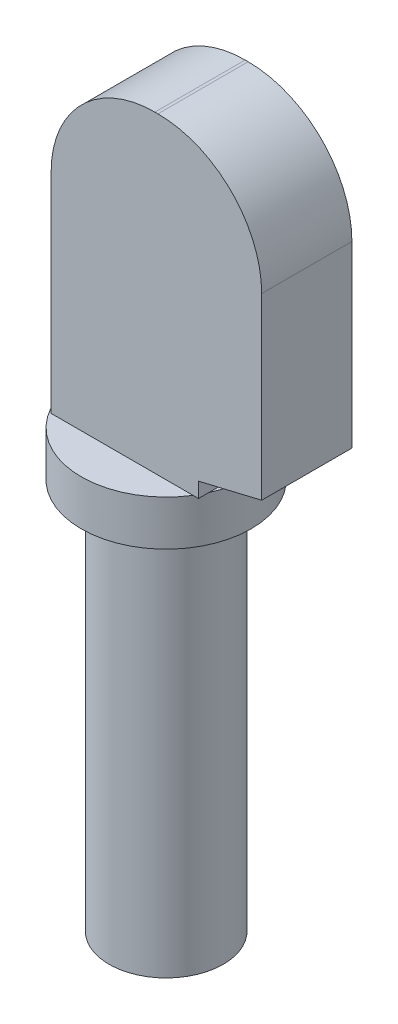
ISO-10303-21;
HEADER;
FILE_DESCRIPTION(('STEP AP214'),'2;1');
FILE_NAME('part.step','',(''),(''),'','','');
FILE_SCHEMA(('AUTOMOTIVE_DESIGN { 1 0 10303 214 1 1 1 1 }'));
ENDSEC;
DATA;
#1=APPLICATION_CONTEXT('core data for automotive mechanical design processes');
#2=APPLICATION_PROTOCOL_DEFINITION('international standard','automotive_design',2000,#1);
#3=PRODUCT_CONTEXT('',#1,'mechanical');
#4=PRODUCT('Part','Part','',(#3));
#5=PRODUCT_RELATED_PRODUCT_CATEGORY('part','',(#4));
#6=PRODUCT_DEFINITION_FORMATION('','',#4);
#7=PRODUCT_DEFINITION_CONTEXT('part definition',#1,'design');
#8=PRODUCT_DEFINITION('design','',#6,#7);
#9=PRODUCT_DEFINITION_SHAPE('','',#8);
#10=(LENGTH_UNIT() NAMED_UNIT(*) SI_UNIT(.MILLI.,.METRE.));
#11=(NAMED_UNIT(*) PLANE_ANGLE_UNIT() SI_UNIT($,.RADIAN.));
#12=(NAMED_UNIT(*) SI_UNIT($,.STERADIAN.) SOLID_ANGLE_UNIT());
#13=UNCERTAINTY_MEASURE_WITH_UNIT(LENGTH_MEASURE(1.E-05),#10,'distance_accuracy_value','');
#14=(GEOMETRIC_REPRESENTATION_CONTEXT(3) GLOBAL_UNCERTAINTY_ASSIGNED_CONTEXT((#13)) GLOBAL_UNIT_ASSIGNED_CONTEXT((#10,
#11,#12)) REPRESENTATION_CONTEXT('',''));
#15=CARTESIAN_POINT('',(0.,0.,0.));
#16=DIRECTION('',(0.,0.,1.));
#17=DIRECTION('',(1.,0.,0.));
#18=AXIS2_PLACEMENT_3D('',#15,#16,#17);
#19=CARTESIAN_POINT('',(2.825,14.5,0.));
#20=DIRECTION('',(0.,1.,0.));
#21=DIRECTION('',(0.,0.,1.));
#22=AXIS2_PLACEMENT_3D('',#19,#20,#21);
#23=PLANE('',#22);
#24=DIRECTION('',(0.,0.,-1.));
#25=VECTOR('',#24,1.);
#26=CARTESIAN_POINT('',(-2.325,14.5,1.5));
#27=LINE('',#26,#25);
#28=CARTESIAN_POINT('',(-2.325,14.5,1.5));
#29=VERTEX_POINT('',#28);
#30=CARTESIAN_POINT('',(-2.325,14.5,-1.5));
#31=VERTEX_POINT('',#30);
#32=EDGE_CURVE('E211',#29,#31,#27,.T.);
#33=ORIENTED_EDGE('',*,*,#32,.T.);
#34=DIRECTION('',(1.,0.,0.));
#35=VECTOR('',#34,1.);
#36=CARTESIAN_POINT('',(2.575,14.5,-1.5));
#37=LINE('',#36,#35);
#38=CARTESIAN_POINT('',(2.39387238590531,14.5,-1.5));
#39=VERTEX_POINT('',#38);
#40=EDGE_CURVE('E58',#31,#39,#37,.T.);
#41=ORIENTED_EDGE('',*,*,#40,.T.);
#42=CARTESIAN_POINT('',(0.,14.5,0.));
#43=DIRECTION('',(0.,-1.,0.));
#44=DIRECTION('',(0.,0.,-1.));
#45=AXIS2_PLACEMENT_3D('',#42,#43,#44);
#46=CIRCLE('',#45,2.825);
#47=CARTESIAN_POINT('',(2.39387238590531,14.5,1.5));
#48=VERTEX_POINT('',#47);
#49=EDGE_CURVE('E144',#48,#39,#46,.T.);
#50=ORIENTED_EDGE('',*,*,#49,.F.);
#51=DIRECTION('',(1.,0.,0.));
#52=VECTOR('',#51,1.);
#53=CARTESIAN_POINT('',(2.575,14.5,1.5));
#54=LINE('',#53,#52);
#55=EDGE_CURVE('E125',#29,#48,#54,.T.);
#56=ORIENTED_EDGE('',*,*,#55,.F.);
#57=EDGE_LOOP('',(#33,#41,#50,#56));
#58=FACE_BOUND('',#57,.T.);
#59=ADVANCED_FACE('F39',(#58),#23,.T.);
#60=CARTESIAN_POINT('',(0.,0.,0.));
#61=DIRECTION('',(0.,-1.,0.));
#62=DIRECTION('',(0.,0.,-1.));
#63=AXIS2_PLACEMENT_3D('',#60,#61,#62);
#64=PLANE('',#63);
#65=CARTESIAN_POINT('',(0.,0.,0.));
#66=DIRECTION('',(0.,-1.,0.));
#67=DIRECTION('',(0.,0.,-1.));
#68=AXIS2_PLACEMENT_3D('',#65,#66,#67);
#69=CIRCLE('',#68,1.9);
#70=CARTESIAN_POINT('',(0.,0.,-1.9));
#71=VERTEX_POINT('',#70);
#72=EDGE_CURVE('E43',#71,#71,#69,.T.);
#73=ORIENTED_EDGE('',*,*,#72,.T.);
#74=EDGE_LOOP('',(#73));
#75=FACE_BOUND('',#74,.T.);
#76=ADVANCED_FACE('F41',(#75),#64,.T.);
#77=CARTESIAN_POINT('',(0.,0.,0.));
#78=DIRECTION('',(0.,-1.,0.));
#79=DIRECTION('',(0.,0.,-1.));
#80=AXIS2_PLACEMENT_3D('',#77,#78,#79);
#81=CYLINDRICAL_SURFACE('',#80,1.9);
#82=CARTESIAN_POINT('',(0.,13.,0.));
#83=DIRECTION('',(0.,-1.,0.));
#84=DIRECTION('',(0.,0.,-1.));
#85=AXIS2_PLACEMENT_3D('',#82,#83,#84);
#86=CIRCLE('',#85,1.9);
#87=CARTESIAN_POINT('',(0.,13.,-1.9));
#88=VERTEX_POINT('',#87);
#89=EDGE_CURVE('E159',#88,#88,#86,.T.);
#90=ORIENTED_EDGE('',*,*,#89,.T.);
#91=EDGE_LOOP('',(#90));
#92=FACE_BOUND('',#91,.T.);
#93=ORIENTED_EDGE('',*,*,#72,.F.);
#94=EDGE_LOOP('',(#93));
#95=FACE_BOUND('',#94,.T.);
#96=ADVANCED_FACE('F169',(#92,#95),#81,.T.);
#97=CARTESIAN_POINT('',(1.9,13.,0.));
#98=DIRECTION('',(0.,-1.,0.));
#99=DIRECTION('',(0.,0.,-1.));
#100=AXIS2_PLACEMENT_3D('',#97,#98,#99);
#101=PLANE('',#100);
#102=CARTESIAN_POINT('',(0.,13.,0.));
#103=DIRECTION('',(0.,-1.,0.));
#104=DIRECTION('',(0.,0.,-1.));
#105=AXIS2_PLACEMENT_3D('',#102,#103,#104);
#106=CIRCLE('',#105,2.825);
#107=CARTESIAN_POINT('',(0.,13.,-2.825));
#108=VERTEX_POINT('',#107);
#109=EDGE_CURVE('E155',#108,#108,#106,.T.);
#110=ORIENTED_EDGE('',*,*,#109,.T.);
#111=EDGE_LOOP('',(#110));
#112=FACE_BOUND('',#111,.T.);
#113=ORIENTED_EDGE('',*,*,#89,.F.);
#114=EDGE_LOOP('',(#113));
#115=FACE_BOUND('',#114,.T.);
#116=ADVANCED_FACE('F171',(#112,#115),#101,.T.);
#117=CARTESIAN_POINT('',(0.,0.,0.));
#118=DIRECTION('',(0.,-1.,0.));
#119=DIRECTION('',(0.,0.,-1.));
#120=AXIS2_PLACEMENT_3D('',#117,#118,#119);
#121=CYLINDRICAL_SURFACE('',#120,2.825);
#122=CARTESIAN_POINT('',(2.575,14.5,-1.16189500386222));
#123=VERTEX_POINT('',#122);
#124=EDGE_CURVE('E149',#39,#123,#46,.T.);
#125=ORIENTED_EDGE('',*,*,#124,.T.);
#126=CARTESIAN_POINT('',(2.575,14.5,1.16189500386222));
#127=VERTEX_POINT('',#126);
#128=EDGE_CURVE('E156',#123,#127,#46,.T.);
#129=ORIENTED_EDGE('',*,*,#128,.T.);
#130=EDGE_CURVE('E142',#127,#48,#46,.T.);
#131=ORIENTED_EDGE('',*,*,#130,.T.);
#132=ORIENTED_EDGE('',*,*,#49,.T.);
#133=EDGE_LOOP('',(#125,#129,#131,#132));
#134=FACE_BOUND('',#133,.T.);
#135=ORIENTED_EDGE('',*,*,#109,.F.);
#136=EDGE_LOOP('',(#135));
#137=FACE_BOUND('',#136,.T.);
#138=ADVANCED_FACE('F176',(#134,#137),#121,.T.);
#139=DIRECTION('',(0.,0.,-1.));
#140=VECTOR('',#139,1.);
#141=CARTESIAN_POINT('',(2.575,14.5,1.5));
#142=LINE('',#141,#140);
#143=EDGE_CURVE('E11',#127,#123,#142,.T.);
#144=ORIENTED_EDGE('',*,*,#143,.F.);
#145=ORIENTED_EDGE('',*,*,#128,.F.);
#146=EDGE_LOOP('',(#144,#145));
#147=FACE_BOUND('',#146,.T.);
#148=ADVANCED_FACE('F182',(#147),#23,.T.);
#149=CARTESIAN_POINT('',(2.575,14.5,1.5));
#150=DIRECTION('',(0.,1.,0.));
#151=DIRECTION('',(0.,0.,1.));
#152=AXIS2_PLACEMENT_3D('',#149,#150,#151);
#153=PLANE('',#152);
#154=ORIENTED_EDGE('',*,*,#124,.F.);
#155=CARTESIAN_POINT('',(2.575,14.5,-1.5));
#156=VERTEX_POINT('',#155);
#157=EDGE_CURVE('E203',#39,#156,#37,.T.);
#158=ORIENTED_EDGE('',*,*,#157,.T.);
#159=EDGE_CURVE('E51',#123,#156,#142,.T.);
#160=ORIENTED_EDGE('',*,*,#159,.F.);
#161=EDGE_LOOP('',(#154,#158,#160));
#162=FACE_BOUND('',#161,.T.);
#163=ADVANCED_FACE('F189',(#162),#153,.F.);
#164=ORIENTED_EDGE('',*,*,#130,.F.);
#165=CARTESIAN_POINT('',(2.575,14.5,1.5));
#166=VERTEX_POINT('',#165);
#167=EDGE_CURVE('E50',#166,#127,#142,.T.);
#168=ORIENTED_EDGE('',*,*,#167,.F.);
#169=EDGE_CURVE('E66',#48,#166,#54,.T.);
#170=ORIENTED_EDGE('',*,*,#169,.F.);
#171=EDGE_LOOP('',(#164,#168,#170));
#172=FACE_BOUND('',#171,.T.);
#173=ADVANCED_FACE('F140',(#172),#153,.F.);
#174=CARTESIAN_POINT('',(2.575,15.,1.5));
#175=DIRECTION('',(-1.,0.,0.));
#176=DIRECTION('',(0.,-1.,0.));
#177=AXIS2_PLACEMENT_3D('',#174,#175,#176);
#178=PLANE('',#177);
#179=DIRECTION('',(0.,1.,0.));
#180=VECTOR('',#179,1.);
#181=CARTESIAN_POINT('',(2.575,15.,-1.5));
#182=LINE('',#181,#180);
#183=CARTESIAN_POINT('',(2.575,15.,-1.5));
#184=VERTEX_POINT('',#183);
#185=EDGE_CURVE('E207',#156,#184,#182,.T.);
#186=ORIENTED_EDGE('',*,*,#185,.T.);
#187=DIRECTION('',(0.,0.,-1.));
#188=VECTOR('',#187,1.);
#189=CARTESIAN_POINT('',(2.575,15.,1.5));
#190=LINE('',#189,#188);
#191=CARTESIAN_POINT('',(2.575,15.,1.5));
#192=VERTEX_POINT('',#191);
#193=EDGE_CURVE('E135',#192,#184,#190,.T.);
#194=ORIENTED_EDGE('',*,*,#193,.F.);
#195=DIRECTION('',(0.,1.,0.));
#196=VECTOR('',#195,1.);
#197=CARTESIAN_POINT('',(2.575,15.,1.5));
#198=LINE('',#197,#196);
#199=EDGE_CURVE('E122',#166,#192,#198,.T.);
#200=ORIENTED_EDGE('',*,*,#199,.F.);
#201=ORIENTED_EDGE('',*,*,#167,.T.);
#202=ORIENTED_EDGE('',*,*,#143,.T.);
#203=ORIENTED_EDGE('',*,*,#159,.T.);
#204=EDGE_LOOP('',(#186,#194,#200,#201,#202,#203));
#205=FACE_BOUND('',#204,.T.);
#206=ADVANCED_FACE('F132',(#205),#178,.F.);
#207=CARTESIAN_POINT('',(4.675,15.5,1.5));
#208=DIRECTION('',(-0.23162052730604,0.972806214685367,0.));
#209=DIRECTION('',(-0.972806214685367,-0.23162052730604,0.));
#210=AXIS2_PLACEMENT_3D('',#207,#208,#209);
#211=PLANE('',#210);
#212=DIRECTION('',(0.972806214685367,0.23162052730604,0.));
#213=VECTOR('',#212,1.);
#214=CARTESIAN_POINT('',(4.675,15.5,-1.5));
#215=LINE('',#214,#213);
#216=CARTESIAN_POINT('',(4.675,15.5,-1.5));
#217=VERTEX_POINT('',#216);
#218=EDGE_CURVE('E214',#184,#217,#215,.T.);
#219=ORIENTED_EDGE('',*,*,#218,.T.);
#220=DIRECTION('',(0.,0.,-1.));
#221=VECTOR('',#220,1.);
#222=CARTESIAN_POINT('',(4.675,15.5,1.5));
#223=LINE('',#222,#221);
#224=CARTESIAN_POINT('',(4.675,15.5,1.5));
#225=VERTEX_POINT('',#224);
#226=EDGE_CURVE('E253',#225,#217,#223,.T.);
#227=ORIENTED_EDGE('',*,*,#226,.F.);
#228=DIRECTION('',(0.972806214685367,0.23162052730604,0.));
#229=VECTOR('',#228,1.);
#230=CARTESIAN_POINT('',(4.675,15.5,1.5));
#231=LINE('',#230,#229);
#232=EDGE_CURVE('E138',#192,#225,#231,.T.);
#233=ORIENTED_EDGE('',*,*,#232,.F.);
#234=ORIENTED_EDGE('',*,*,#193,.T.);
#235=EDGE_LOOP('',(#219,#227,#233,#234));
#236=FACE_BOUND('',#235,.T.);
#237=ADVANCED_FACE('F262',(#236),#211,.F.);
#238=CARTESIAN_POINT('',(4.675,21.45,1.5));
#239=DIRECTION('',(-1.,0.,0.));
#240=DIRECTION('',(0.,-1.,0.));
#241=AXIS2_PLACEMENT_3D('',#238,#239,#240);
#242=PLANE('',#241);
#243=DIRECTION('',(0.,1.,0.));
#244=VECTOR('',#243,1.);
#245=CARTESIAN_POINT('',(4.675,21.45,-1.5));
#246=LINE('',#245,#244);
#247=CARTESIAN_POINT('',(4.675,21.45,-1.5));
#248=VERTEX_POINT('',#247);
#249=EDGE_CURVE('E222',#217,#248,#246,.T.);
#250=ORIENTED_EDGE('',*,*,#249,.T.);
#251=DIRECTION('',(0.,0.,-1.));
#252=VECTOR('',#251,1.);
#253=CARTESIAN_POINT('',(4.675,21.45,1.5));
#254=LINE('',#253,#252);
#255=CARTESIAN_POINT('',(4.675,21.45,1.5));
#256=VERTEX_POINT('',#255);
#257=EDGE_CURVE('E250',#256,#248,#254,.T.);
#258=ORIENTED_EDGE('',*,*,#257,.F.);
#259=DIRECTION('',(0.,1.,0.));
#260=VECTOR('',#259,1.);
#261=CARTESIAN_POINT('',(4.675,21.45,1.5));
#262=LINE('',#261,#260);
#263=EDGE_CURVE('E275',#225,#256,#262,.T.);
#264=ORIENTED_EDGE('',*,*,#263,.F.);
#265=ORIENTED_EDGE('',*,*,#226,.T.);
#266=EDGE_LOOP('',(#250,#258,#264,#265));
#267=FACE_BOUND('',#266,.T.);
#268=ADVANCED_FACE('F266',(#267),#242,.F.);
#269=CARTESIAN_POINT('',(1.225,21.45,1.5));
#270=DIRECTION('',(0.,0.,-1.));
#271=DIRECTION('',(-1.,0.,0.));
#272=AXIS2_PLACEMENT_3D('',#269,#270,#271);
#273=CYLINDRICAL_SURFACE('',#272,3.45);
#274=CARTESIAN_POINT('',(1.225,21.45,-1.5));
#275=DIRECTION('',(0.,0.,1.));
#276=DIRECTION('',(-1.,0.,0.));
#277=AXIS2_PLACEMENT_3D('',#274,#275,#276);
#278=CIRCLE('',#277,3.45);
#279=CARTESIAN_POINT('',(1.225,24.9,-1.5));
#280=VERTEX_POINT('',#279);
#281=EDGE_CURVE('E225',#248,#280,#278,.T.);
#282=ORIENTED_EDGE('',*,*,#281,.T.);
#283=DIRECTION('',(0.,0.,-1.));
#284=VECTOR('',#283,1.);
#285=CARTESIAN_POINT('',(1.225,24.9,1.5));
#286=LINE('',#285,#284);
#287=CARTESIAN_POINT('',(1.225,24.9,1.5));
#288=VERTEX_POINT('',#287);
#289=EDGE_CURVE('E246',#288,#280,#286,.T.);
#290=ORIENTED_EDGE('',*,*,#289,.F.);
#291=CARTESIAN_POINT('',(1.225,21.45,1.5));
#292=DIRECTION('',(0.,0.,1.));
#293=DIRECTION('',(-1.,0.,0.));
#294=AXIS2_PLACEMENT_3D('',#291,#292,#293);
#295=CIRCLE('',#294,3.45);
#296=EDGE_CURVE('E271',#256,#288,#295,.T.);
#297=ORIENTED_EDGE('',*,*,#296,.F.);
#298=ORIENTED_EDGE('',*,*,#257,.T.);
#299=EDGE_LOOP('',(#282,#290,#297,#298));
#300=FACE_BOUND('',#299,.T.);
#301=ADVANCED_FACE('F269',(#300),#273,.T.);
#302=CARTESIAN_POINT('',(1.12500000000002,24.9,1.5));
#303=DIRECTION('',(0.,-1.,0.));
#304=DIRECTION('',(1.,0.,0.));
#305=AXIS2_PLACEMENT_3D('',#302,#303,#304);
#306=PLANE('',#305);
#307=DIRECTION('',(-1.,0.,0.));
#308=VECTOR('',#307,1.);
#309=CARTESIAN_POINT('',(1.12500000000002,24.9,-1.5));
#310=LINE('',#309,#308);
#311=CARTESIAN_POINT('',(1.12500000000002,24.9,-1.5));
#312=VERTEX_POINT('',#311);
#313=EDGE_CURVE('E228',#280,#312,#310,.T.);
#314=ORIENTED_EDGE('',*,*,#313,.T.);
#315=DIRECTION('',(0.,0.,-1.));
#316=VECTOR('',#315,1.);
#317=CARTESIAN_POINT('',(1.12500000000002,24.9,1.5));
#318=LINE('',#317,#316);
#319=CARTESIAN_POINT('',(1.12500000000002,24.9,1.5));
#320=VERTEX_POINT('',#319);
#321=EDGE_CURVE('E242',#320,#312,#318,.T.);
#322=ORIENTED_EDGE('',*,*,#321,.F.);
#323=DIRECTION('',(-1.,0.,0.));
#324=VECTOR('',#323,1.);
#325=CARTESIAN_POINT('',(1.12500000000002,24.9,1.5));
#326=LINE('',#325,#324);
#327=EDGE_CURVE('E274',#288,#320,#326,.T.);
#328=ORIENTED_EDGE('',*,*,#327,.F.);
#329=ORIENTED_EDGE('',*,*,#289,.T.);
#330=EDGE_LOOP('',(#314,#322,#328,#329));
#331=FACE_BOUND('',#330,.T.);
#332=ADVANCED_FACE('F297',(#331),#306,.F.);
#333=CARTESIAN_POINT('',(1.125,21.45,1.5));
#334=DIRECTION('',(0.,0.,-1.));
#335=DIRECTION('',(-1.,0.,0.));
#336=AXIS2_PLACEMENT_3D('',#333,#334,#335);
#337=CYLINDRICAL_SURFACE('',#336,3.45);
#338=CARTESIAN_POINT('',(1.125,21.45,-1.5));
#339=DIRECTION('',(0.,0.,1.));
#340=DIRECTION('',(-1.,0.,0.));
#341=AXIS2_PLACEMENT_3D('',#338,#339,#340);
#342=CIRCLE('',#341,3.45);
#343=CARTESIAN_POINT('',(-2.325,21.45,-1.5));
#344=VERTEX_POINT('',#343);
#345=EDGE_CURVE('E231',#312,#344,#342,.T.);
#346=ORIENTED_EDGE('',*,*,#345,.T.);
#347=DIRECTION('',(0.,0.,-1.));
#348=VECTOR('',#347,1.);
#349=CARTESIAN_POINT('',(-2.325,21.45,1.5));
#350=LINE('',#349,#348);
#351=CARTESIAN_POINT('',(-2.325,21.45,1.5));
#352=VERTEX_POINT('',#351);
#353=EDGE_CURVE('E238',#352,#344,#350,.T.);
#354=ORIENTED_EDGE('',*,*,#353,.F.);
#355=CARTESIAN_POINT('',(1.125,21.45,1.5));
#356=DIRECTION('',(0.,0.,1.));
#357=DIRECTION('',(-1.,0.,0.));
#358=AXIS2_PLACEMENT_3D('',#355,#356,#357);
#359=CIRCLE('',#358,3.45);
#360=EDGE_CURVE('E279',#320,#352,#359,.T.);
#361=ORIENTED_EDGE('',*,*,#360,.F.);
#362=ORIENTED_EDGE('',*,*,#321,.T.);
#363=EDGE_LOOP('',(#346,#354,#361,#362));
#364=FACE_BOUND('',#363,.T.);
#365=ADVANCED_FACE('F294',(#364),#337,.T.);
#366=CARTESIAN_POINT('',(-2.325,14.5,1.5));
#367=DIRECTION('',(1.,0.,0.));
#368=DIRECTION('',(0.,1.,0.));
#369=AXIS2_PLACEMENT_3D('',#366,#367,#368);
#370=PLANE('',#369);
#371=DIRECTION('',(0.,-1.,0.));
#372=VECTOR('',#371,1.);
#373=CARTESIAN_POINT('',(-2.325,14.5,-1.5));
#374=LINE('',#373,#372);
#375=EDGE_CURVE('E128',#344,#31,#374,.T.);
#376=ORIENTED_EDGE('',*,*,#375,.T.);
#377=ORIENTED_EDGE('',*,*,#32,.F.);
#378=DIRECTION('',(0.,-1.,0.));
#379=VECTOR('',#378,1.);
#380=CARTESIAN_POINT('',(-2.325,14.5,1.5));
#381=LINE('',#380,#379);
#382=EDGE_CURVE('E217',#352,#29,#381,.T.);
#383=ORIENTED_EDGE('',*,*,#382,.F.);
#384=ORIENTED_EDGE('',*,*,#353,.T.);
#385=EDGE_LOOP('',(#376,#377,#383,#384));
#386=FACE_BOUND('',#385,.T.);
#387=ADVANCED_FACE('F289',(#386),#370,.F.);
#388=CARTESIAN_POINT('',(1.125,21.45,1.5));
#389=DIRECTION('',(0.,0.,-1.));
#390=DIRECTION('',(-1.,0.,0.));
#391=AXIS2_PLACEMENT_3D('',#388,#389,#390);
#392=PLANE('',#391);
#393=ORIENTED_EDGE('',*,*,#55,.T.);
#394=ORIENTED_EDGE('',*,*,#169,.T.);
#395=ORIENTED_EDGE('',*,*,#199,.T.);
#396=ORIENTED_EDGE('',*,*,#232,.T.);
#397=ORIENTED_EDGE('',*,*,#263,.T.);
#398=ORIENTED_EDGE('',*,*,#296,.T.);
#399=ORIENTED_EDGE('',*,*,#327,.T.);
#400=ORIENTED_EDGE('',*,*,#360,.T.);
#401=ORIENTED_EDGE('',*,*,#382,.T.);
#402=EDGE_LOOP('',(#393,#394,#395,#396,#397,#398,#399,#400,#401));
#403=FACE_BOUND('',#402,.T.);
#404=ADVANCED_FACE('F121',(#403),#392,.F.);
#405=CARTESIAN_POINT('',(1.125,21.45,-1.5));
#406=DIRECTION('',(0.,0.,-1.));
#407=DIRECTION('',(-1.,0.,0.));
#408=AXIS2_PLACEMENT_3D('',#405,#406,#407);
#409=PLANE('',#408);
#410=ORIENTED_EDGE('',*,*,#40,.F.);
#411=ORIENTED_EDGE('',*,*,#375,.F.);
#412=ORIENTED_EDGE('',*,*,#345,.F.);
#413=ORIENTED_EDGE('',*,*,#313,.F.);
#414=ORIENTED_EDGE('',*,*,#281,.F.);
#415=ORIENTED_EDGE('',*,*,#249,.F.);
#416=ORIENTED_EDGE('',*,*,#218,.F.);
#417=ORIENTED_EDGE('',*,*,#185,.F.);
#418=ORIENTED_EDGE('',*,*,#157,.F.);
#419=EDGE_LOOP('',(#410,#411,#412,#413,#414,#415,#416,#417,#418));
#420=FACE_BOUND('',#419,.T.);
#421=ADVANCED_FACE('F205',(#420),#409,.T.);
#422=CLOSED_SHELL('',(#59,#76,#96,#116,#138,#148,#163,#173,#206,#237,#268,#301,#332,#365,#387,
#404,#421));
#423=MANIFOLD_SOLID_BREP('B2',#422);
#424=ADVANCED_BREP_SHAPE_REPRESENTATION('',(#18,#423),#14);
#425=SHAPE_DEFINITION_REPRESENTATION(#9,#424);
ENDSEC;
END-ISO-10303-21;
